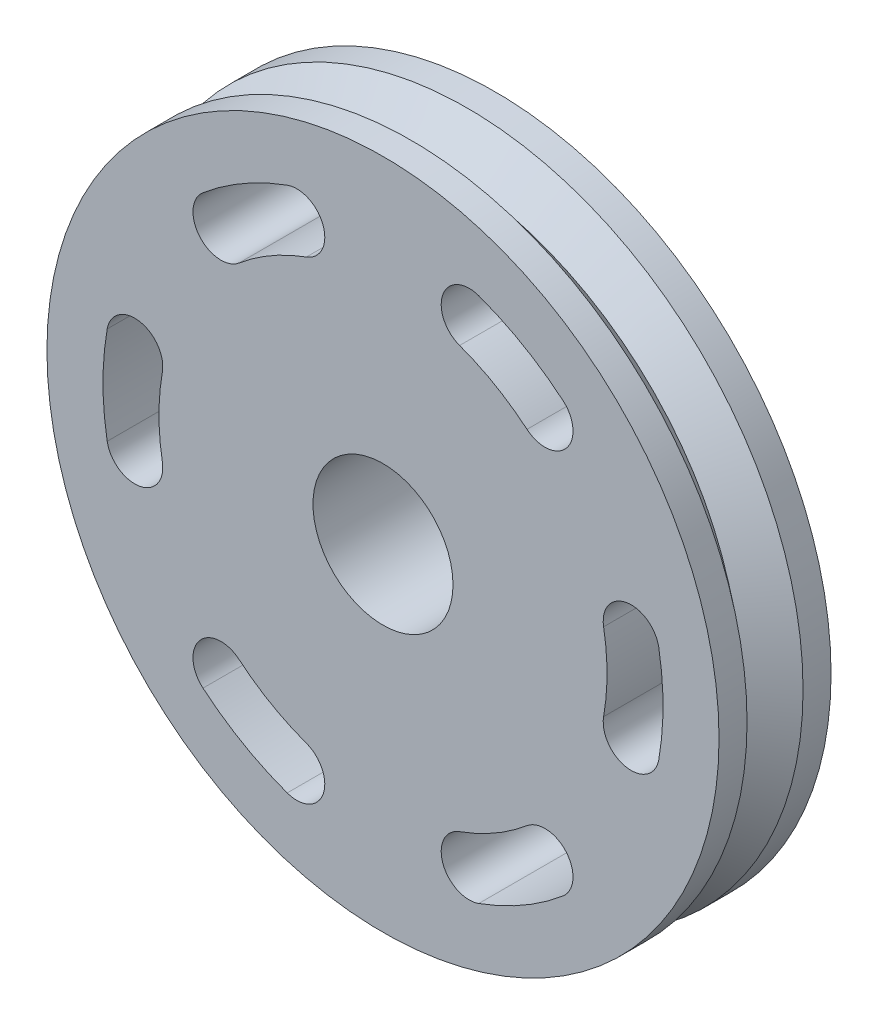
ISO-10303-21;
HEADER;
FILE_DESCRIPTION(('STEP AP214'),'2;1');
FILE_NAME('part.step','',(''),(''),'','','');
FILE_SCHEMA(('AUTOMOTIVE_DESIGN { 1 0 10303 214 1 1 1 1 }'));
ENDSEC;
DATA;
#1=APPLICATION_CONTEXT('core data for automotive mechanical design processes');
#2=APPLICATION_PROTOCOL_DEFINITION('international standard','automotive_design',2000,#1);
#3=PRODUCT_CONTEXT('',#1,'mechanical');
#4=PRODUCT('Part','Part','',(#3));
#5=PRODUCT_RELATED_PRODUCT_CATEGORY('part','',(#4));
#6=PRODUCT_DEFINITION_FORMATION('','',#4);
#7=PRODUCT_DEFINITION_CONTEXT('part definition',#1,'design');
#8=PRODUCT_DEFINITION('design','',#6,#7);
#9=PRODUCT_DEFINITION_SHAPE('','',#8);
#10=(LENGTH_UNIT() NAMED_UNIT(*) SI_UNIT(.MILLI.,.METRE.));
#11=(NAMED_UNIT(*) PLANE_ANGLE_UNIT() SI_UNIT($,.RADIAN.));
#12=(NAMED_UNIT(*) SI_UNIT($,.STERADIAN.) SOLID_ANGLE_UNIT());
#13=UNCERTAINTY_MEASURE_WITH_UNIT(LENGTH_MEASURE(1.E-05),#10,'distance_accuracy_value','');
#14=(GEOMETRIC_REPRESENTATION_CONTEXT(3) GLOBAL_UNCERTAINTY_ASSIGNED_CONTEXT((#13)) GLOBAL_UNIT_ASSIGNED_CONTEXT((#10,
#11,#12)) REPRESENTATION_CONTEXT('',''));
#15=CARTESIAN_POINT('',(0.,0.,0.));
#16=DIRECTION('',(0.,0.,1.));
#17=DIRECTION('',(1.,0.,0.));
#18=AXIS2_PLACEMENT_3D('',#15,#16,#17);
#19=CARTESIAN_POINT('',(0.,0.,-0.5));
#20=DIRECTION('',(0.,0.,-1.));
#21=DIRECTION('',(-1.,0.,0.));
#22=AXIS2_PLACEMENT_3D('',#19,#20,#21);
#23=PLANE('',#22);
#24=CARTESIAN_POINT('',(-2.21581744427747,-0.390708399750611,-0.500000000000001));
#25=DIRECTION('',(0.,0.,1.));
#26=DIRECTION('',(1.,0.,0.));
#27=AXIS2_PLACEMENT_3D('',#24,#25,#26);
#28=CIRCLE('',#27,0.25);
#29=CARTESIAN_POINT('',(-2.46201938253052,-0.434120444167345,-0.500000000000001));
#30=VERTEX_POINT('',#29);
#31=CARTESIAN_POINT('',(-1.96961550602441,-0.347296355333876,-0.500000000000001));
#32=VERTEX_POINT('',#31);
#33=EDGE_CURVE('E277',#30,#32,#28,.T.);
#34=ORIENTED_EDGE('',*,*,#33,.T.);
#35=CARTESIAN_POINT('',(0.,0.,-0.500000000000001));
#36=DIRECTION('',(0.,0.,1.));
#37=DIRECTION('',(1.,0.,0.));
#38=AXIS2_PLACEMENT_3D('',#35,#36,#37);
#39=CIRCLE('',#38,2.);
#40=CARTESIAN_POINT('',(-1.96961550602442,0.347296355333847,-0.5));
#41=VERTEX_POINT('',#40);
#42=EDGE_CURVE('E294',#41,#32,#39,.T.);
#43=ORIENTED_EDGE('',*,*,#42,.F.);
#44=CARTESIAN_POINT('',(-2.21581744427747,0.390708399750578,-0.500000000000001));
#45=DIRECTION('',(0.,0.,1.));
#46=DIRECTION('',(1.,0.,0.));
#47=AXIS2_PLACEMENT_3D('',#44,#45,#46);
#48=CIRCLE('',#47,0.250000000000001);
#49=CARTESIAN_POINT('',(-2.46201938253053,0.434120444167309,-0.500000000000001));
#50=VERTEX_POINT('',#49);
#51=EDGE_CURVE('E57',#41,#50,#48,.T.);
#52=ORIENTED_EDGE('',*,*,#51,.T.);
#53=CARTESIAN_POINT('',(0.,0.,-0.500000000000001));
#54=DIRECTION('',(0.,0.,1.));
#55=DIRECTION('',(1.,0.,0.));
#56=AXIS2_PLACEMENT_3D('',#53,#54,#55);
#57=CIRCLE('',#56,2.5);
#58=EDGE_CURVE('E261',#50,#30,#57,.T.);
#59=ORIENTED_EDGE('',*,*,#58,.T.);
#60=EDGE_LOOP('',(#34,#43,#52,#59));
#61=FACE_BOUND('',#60,.T.);
#62=CARTESIAN_POINT('',(-1.44627212179472,-1.7235999970177,-0.500000000000001));
#63=DIRECTION('',(0.,0.,1.));
#64=DIRECTION('',(1.,0.,0.));
#65=AXIS2_PLACEMENT_3D('',#62,#63,#64);
#66=CIRCLE('',#65,0.25);
#67=CARTESIAN_POINT('',(-1.28557521937309,-1.53208888623795,-0.500000000000001));
#68=VERTEX_POINT('',#67);
#69=CARTESIAN_POINT('',(-1.60696902421636,-1.91511110779744,-0.500000000000001));
#70=VERTEX_POINT('',#69);
#71=EDGE_CURVE('E320',#68,#70,#66,.T.);
#72=ORIENTED_EDGE('',*,*,#71,.T.);
#73=CARTESIAN_POINT('',(0.,0.,-0.500000000000001));
#74=DIRECTION('',(0.,0.,1.));
#75=DIRECTION('',(1.,0.,0.));
#76=AXIS2_PLACEMENT_3D('',#73,#74,#75);
#77=CIRCLE('',#76,2.5);
#78=CARTESIAN_POINT('',(-0.855050358314182,-2.34923155196477,-0.5));
#79=VERTEX_POINT('',#78);
#80=EDGE_CURVE('E334',#70,#79,#77,.T.);
#81=ORIENTED_EDGE('',*,*,#80,.T.);
#82=CARTESIAN_POINT('',(-0.769545322482764,-2.11430839676829,-0.500000000000001));
#83=DIRECTION('',(0.,0.,1.));
#84=DIRECTION('',(1.,0.,0.));
#85=AXIS2_PLACEMENT_3D('',#82,#83,#84);
#86=CIRCLE('',#85,0.25);
#87=CARTESIAN_POINT('',(-0.684040286651346,-1.87938524157182,-0.500000000000001));
#88=VERTEX_POINT('',#87);
#89=EDGE_CURVE('E65',#79,#88,#86,.T.);
#90=ORIENTED_EDGE('',*,*,#89,.T.);
#91=CARTESIAN_POINT('',(0.,0.,-0.500000000000001));
#92=DIRECTION('',(0.,0.,1.));
#93=DIRECTION('',(1.,0.,0.));
#94=AXIS2_PLACEMENT_3D('',#91,#92,#93);
#95=CIRCLE('',#94,2.);
#96=EDGE_CURVE('E304',#68,#88,#95,.T.);
#97=ORIENTED_EDGE('',*,*,#96,.F.);
#98=EDGE_LOOP('',(#72,#81,#90,#97));
#99=FACE_BOUND('',#98,.T.);
#100=CARTESIAN_POINT('',(0.769545322482751,-2.1143083967683,-0.500000000000001));
#101=DIRECTION('',(0.,0.,1.));
#102=DIRECTION('',(1.,0.,0.));
#103=AXIS2_PLACEMENT_3D('',#100,#101,#102);
#104=CIRCLE('',#103,0.250000000000001);
#105=CARTESIAN_POINT('',(0.684040286651333,-1.87938524157182,-0.500000000000001));
#106=VERTEX_POINT('',#105);
#107=CARTESIAN_POINT('',(0.855050358314166,-2.34923155196477,-0.500000000000001));
#108=VERTEX_POINT('',#107);
#109=EDGE_CURVE('E361',#106,#108,#104,.T.);
#110=ORIENTED_EDGE('',*,*,#109,.T.);
#111=CARTESIAN_POINT('',(0.,0.,-0.500000000000001));
#112=DIRECTION('',(0.,0.,1.));
#113=DIRECTION('',(1.,0.,0.));
#114=AXIS2_PLACEMENT_3D('',#111,#112,#113);
#115=CIRCLE('',#114,2.5);
#116=CARTESIAN_POINT('',(1.60696902421635,-1.91511110779745,-0.5));
#117=VERTEX_POINT('',#116);
#118=EDGE_CURVE('E377',#108,#117,#115,.T.);
#119=ORIENTED_EDGE('',*,*,#118,.T.);
#120=CARTESIAN_POINT('',(1.44627212179471,-1.7235999970177,-0.500000000000001));
#121=DIRECTION('',(0.,0.,1.));
#122=DIRECTION('',(1.,0.,0.));
#123=AXIS2_PLACEMENT_3D('',#120,#121,#122);
#124=CIRCLE('',#123,0.25);
#125=CARTESIAN_POINT('',(1.28557521937308,-1.53208888623796,-0.500000000000001));
#126=VERTEX_POINT('',#125);
#127=EDGE_CURVE('E373',#117,#126,#124,.T.);
#128=ORIENTED_EDGE('',*,*,#127,.T.);
#129=CARTESIAN_POINT('',(0.,0.,-0.500000000000001));
#130=DIRECTION('',(0.,0.,1.));
#131=DIRECTION('',(1.,0.,0.));
#132=AXIS2_PLACEMENT_3D('',#129,#130,#131);
#133=CIRCLE('',#132,2.);
#134=EDGE_CURVE('E345',#106,#126,#133,.T.);
#135=ORIENTED_EDGE('',*,*,#134,.F.);
#136=EDGE_LOOP('',(#110,#119,#128,#135));
#137=FACE_BOUND('',#136,.T.);
#138=CARTESIAN_POINT('',(2.21581744427747,-0.390708399750593,-0.500000000000001));
#139=DIRECTION('',(0.,0.,1.));
#140=DIRECTION('',(1.,0.,0.));
#141=AXIS2_PLACEMENT_3D('',#138,#139,#140);
#142=CIRCLE('',#141,0.250000000000001);
#143=CARTESIAN_POINT('',(1.96961550602442,-0.347296355333861,-0.500000000000001));
#144=VERTEX_POINT('',#143);
#145=CARTESIAN_POINT('',(2.46201938253052,-0.434120444167326,-0.500000000000001));
#146=VERTEX_POINT('',#145);
#147=EDGE_CURVE('E403',#144,#146,#142,.T.);
#148=ORIENTED_EDGE('',*,*,#147,.T.);
#149=CARTESIAN_POINT('',(0.,0.,-0.500000000000001));
#150=DIRECTION('',(0.,0.,1.));
#151=DIRECTION('',(1.,0.,0.));
#152=AXIS2_PLACEMENT_3D('',#149,#150,#151);
#153=CIRCLE('',#152,2.5);
#154=CARTESIAN_POINT('',(2.46201938253052,0.434120444167328,-0.5));
#155=VERTEX_POINT('',#154);
#156=EDGE_CURVE('E419',#146,#155,#153,.T.);
#157=ORIENTED_EDGE('',*,*,#156,.T.);
#158=CARTESIAN_POINT('',(2.21581744427747,0.390708399750595,-0.500000000000001));
#159=DIRECTION('',(0.,0.,1.));
#160=DIRECTION('',(1.,0.,0.));
#161=AXIS2_PLACEMENT_3D('',#158,#159,#160);
#162=CIRCLE('',#161,0.25);
#163=CARTESIAN_POINT('',(1.96961550602442,0.347296355333862,-0.500000000000001));
#164=VERTEX_POINT('',#163);
#165=EDGE_CURVE('E415',#155,#164,#162,.T.);
#166=ORIENTED_EDGE('',*,*,#165,.T.);
#167=CARTESIAN_POINT('',(0.,0.,-0.500000000000001));
#168=DIRECTION('',(0.,0.,1.));
#169=DIRECTION('',(1.,0.,0.));
#170=AXIS2_PLACEMENT_3D('',#167,#168,#169);
#171=CIRCLE('',#170,2.);
#172=EDGE_CURVE('E388',#144,#164,#171,.T.);
#173=ORIENTED_EDGE('',*,*,#172,.F.);
#174=EDGE_LOOP('',(#148,#157,#166,#173));
#175=FACE_BOUND('',#174,.T.);
#176=CARTESIAN_POINT('',(0.,0.,-0.500000000000001));
#177=DIRECTION('',(0.,0.,1.));
#178=DIRECTION('',(1.,0.,0.));
#179=AXIS2_PLACEMENT_3D('',#176,#177,#178);
#180=CIRCLE('',#179,0.625);
#181=CARTESIAN_POINT('',(0.625,0.,-0.500000000000001));
#182=VERTEX_POINT('',#181);
#183=EDGE_CURVE('E232',#182,#182,#180,.T.);
#184=ORIENTED_EDGE('',*,*,#183,.T.);
#185=EDGE_LOOP('',(#184));
#186=FACE_BOUND('',#185,.T.);
#187=CARTESIAN_POINT('',(1.44627212179471,1.72359999701771,-0.500000000000001));
#188=DIRECTION('',(0.,0.,1.));
#189=DIRECTION('',(1.,0.,0.));
#190=AXIS2_PLACEMENT_3D('',#187,#188,#189);
#191=CIRCLE('',#190,0.250000000000001);
#192=CARTESIAN_POINT('',(1.28557521937307,1.53208888623796,-0.500000000000001));
#193=VERTEX_POINT('',#192);
#194=CARTESIAN_POINT('',(1.60696902421634,1.91511110779745,-0.500000000000001));
#195=VERTEX_POINT('',#194);
#196=EDGE_CURVE('E210',#193,#195,#191,.T.);
#197=ORIENTED_EDGE('',*,*,#196,.T.);
#198=CARTESIAN_POINT('',(0.,0.,-0.500000000000001));
#199=DIRECTION('',(0.,0.,1.));
#200=DIRECTION('',(1.,0.,0.));
#201=AXIS2_PLACEMENT_3D('',#198,#199,#200);
#202=CIRCLE('',#201,2.5);
#203=CARTESIAN_POINT('',(0.855050358314165,2.34923155196477,-0.5));
#204=VERTEX_POINT('',#203);
#205=EDGE_CURVE('E251',#195,#204,#202,.T.);
#206=ORIENTED_EDGE('',*,*,#205,.T.);
#207=CARTESIAN_POINT('',(0.769545322482749,2.1143083967683,-0.500000000000001));
#208=DIRECTION('',(0.,0.,1.));
#209=DIRECTION('',(1.,0.,0.));
#210=AXIS2_PLACEMENT_3D('',#207,#208,#209);
#211=CIRCLE('',#210,0.25);
#212=CARTESIAN_POINT('',(0.684040286651332,1.87938524157182,-0.500000000000001));
#213=VERTEX_POINT('',#212);
#214=EDGE_CURVE('E246',#204,#213,#211,.T.);
#215=ORIENTED_EDGE('',*,*,#214,.T.);
#216=CARTESIAN_POINT('',(0.,0.,-0.500000000000001));
#217=DIRECTION('',(0.,0.,1.));
#218=DIRECTION('',(1.,0.,0.));
#219=AXIS2_PLACEMENT_3D('',#216,#217,#218);
#220=CIRCLE('',#219,2.);
#221=EDGE_CURVE('E243',#193,#213,#220,.T.);
#222=ORIENTED_EDGE('',*,*,#221,.F.);
#223=EDGE_LOOP('',(#197,#206,#215,#222));
#224=FACE_BOUND('',#223,.T.);
#225=CARTESIAN_POINT('',(-0.769545322482766,2.11430839676829,-0.500000000000001));
#226=DIRECTION('',(0.,0.,1.));
#227=DIRECTION('',(1.,0.,0.));
#228=AXIS2_PLACEMENT_3D('',#225,#226,#227);
#229=CIRCLE('',#228,0.25);
#230=CARTESIAN_POINT('',(-0.684040286651346,1.87938524157181,-0.500000000000001));
#231=VERTEX_POINT('',#230);
#232=CARTESIAN_POINT('',(-0.855050358314183,2.34923155196477,-0.500000000000001));
#233=VERTEX_POINT('',#232);
#234=EDGE_CURVE('E426',#231,#233,#229,.T.);
#235=ORIENTED_EDGE('',*,*,#234,.T.);
#236=CARTESIAN_POINT('',(0.,0.,-0.500000000000001));
#237=DIRECTION('',(0.,0.,1.));
#238=DIRECTION('',(1.,0.,0.));
#239=AXIS2_PLACEMENT_3D('',#236,#237,#238);
#240=CIRCLE('',#239,2.5);
#241=CARTESIAN_POINT('',(-1.60696902421636,1.91511110779744,-0.5));
#242=VERTEX_POINT('',#241);
#243=EDGE_CURVE('E430',#233,#242,#240,.T.);
#244=ORIENTED_EDGE('',*,*,#243,.T.);
#245=CARTESIAN_POINT('',(-1.44627212179472,1.72359999701769,-0.500000000000001));
#246=DIRECTION('',(0.,0.,1.));
#247=DIRECTION('',(1.,0.,0.));
#248=AXIS2_PLACEMENT_3D('',#245,#246,#247);
#249=CIRCLE('',#248,0.25);
#250=CARTESIAN_POINT('',(-1.28557521937309,1.53208888623795,-0.500000000000001));
#251=VERTEX_POINT('',#250);
#252=EDGE_CURVE('E435',#242,#251,#249,.T.);
#253=ORIENTED_EDGE('',*,*,#252,.T.);
#254=CARTESIAN_POINT('',(0.,0.,-0.500000000000001));
#255=DIRECTION('',(0.,0.,1.));
#256=DIRECTION('',(1.,0.,0.));
#257=AXIS2_PLACEMENT_3D('',#254,#255,#256);
#258=CIRCLE('',#257,2.);
#259=EDGE_CURVE('E439',#231,#251,#258,.T.);
#260=ORIENTED_EDGE('',*,*,#259,.F.);
#261=EDGE_LOOP('',(#235,#244,#253,#260));
#262=FACE_BOUND('',#261,.T.);
#263=CARTESIAN_POINT('',(0.,0.,-0.500000000000001));
#264=DIRECTION('',(0.,0.,1.));
#265=DIRECTION('',(1.,0.,0.));
#266=AXIS2_PLACEMENT_3D('',#263,#264,#265);
#267=CIRCLE('',#266,3.);
#268=CARTESIAN_POINT('',(3.,0.,-0.500000000000001));
#269=VERTEX_POINT('',#268);
#270=EDGE_CURVE('E11',#269,#269,#267,.T.);
#271=ORIENTED_EDGE('',*,*,#270,.F.);
#272=EDGE_LOOP('',(#271));
#273=FACE_BOUND('',#272,.T.);
#274=ADVANCED_FACE('F42',(#61,#99,#137,#175,#186,#224,#262,#273),#23,.T.);
#275=CARTESIAN_POINT('',(0.,0.,1.40451509183664));
#276=DIRECTION('',(0.,0.,1.));
#277=DIRECTION('',(1.,0.,0.));
#278=AXIS2_PLACEMENT_3D('',#275,#276,#277);
#279=CYLINDRICAL_SURFACE('',#278,3.);
#280=ORIENTED_EDGE('',*,*,#270,.T.);
#281=EDGE_LOOP('',(#280));
#282=FACE_BOUND('',#281,.T.);
#283=CARTESIAN_POINT('',(0.,0.,-0.250000000000001));
#284=DIRECTION('',(0.,0.,1.));
#285=DIRECTION('',(1.,0.,0.));
#286=AXIS2_PLACEMENT_3D('',#283,#284,#285);
#287=CIRCLE('',#286,3.);
#288=CARTESIAN_POINT('',(3.,0.,-0.250000000000001));
#289=VERTEX_POINT('',#288);
#290=EDGE_CURVE('E50',#289,#289,#287,.T.);
#291=ORIENTED_EDGE('',*,*,#290,.F.);
#292=EDGE_LOOP('',(#291));
#293=FACE_BOUND('',#292,.T.);
#294=ADVANCED_FACE('F487',(#282,#293),#279,.T.);
#295=CARTESIAN_POINT('',(0.,0.,0.));
#296=DIRECTION('',(0.,0.,-1.));
#297=DIRECTION('',(-1.,0.,0.));
#298=AXIS2_PLACEMENT_3D('',#295,#296,#297);
#299=CONICAL_SURFACE('',#298,2.69,0.892133836046583);
#300=ORIENTED_EDGE('',*,*,#290,.T.);
#301=EDGE_LOOP('',(#300));
#302=FACE_BOUND('',#301,.T.);
#303=CARTESIAN_POINT('',(0.,0.,0.));
#304=DIRECTION('',(0.,0.,1.));
#305=DIRECTION('',(1.,0.,0.));
#306=AXIS2_PLACEMENT_3D('',#303,#304,#305);
#307=CIRCLE('',#306,2.69);
#308=CARTESIAN_POINT('',(2.69,0.,0.));
#309=VERTEX_POINT('',#308);
#310=EDGE_CURVE('E476',#309,#309,#307,.T.);
#311=ORIENTED_EDGE('',*,*,#310,.F.);
#312=EDGE_LOOP('',(#311));
#313=FACE_BOUND('',#312,.T.);
#314=ADVANCED_FACE('F484',(#302,#313),#299,.T.);
#315=CARTESIAN_POINT('',(0.,0.,0.));
#316=DIRECTION('',(0.,0.,1.));
#317=DIRECTION('',(1.,0.,0.));
#318=AXIS2_PLACEMENT_3D('',#315,#316,#317);
#319=CONICAL_SURFACE('',#318,2.69,0.892133836046582);
#320=CARTESIAN_POINT('',(0.,0.,0.250000000000001));
#321=DIRECTION('',(0.,0.,1.));
#322=DIRECTION('',(1.,0.,0.));
#323=AXIS2_PLACEMENT_3D('',#320,#321,#322);
#324=CIRCLE('',#323,3.);
#325=CARTESIAN_POINT('',(3.,0.,0.250000000000001));
#326=VERTEX_POINT('',#325);
#327=EDGE_CURVE('E472',#326,#326,#324,.T.);
#328=ORIENTED_EDGE('',*,*,#327,.F.);
#329=EDGE_LOOP('',(#328));
#330=FACE_BOUND('',#329,.T.);
#331=ORIENTED_EDGE('',*,*,#310,.T.);
#332=EDGE_LOOP('',(#331));
#333=FACE_BOUND('',#332,.T.);
#334=ADVANCED_FACE('F494',(#330,#333),#319,.T.);
#335=CARTESIAN_POINT('',(0.,0.,1.40451509183664));
#336=DIRECTION('',(0.,0.,1.));
#337=DIRECTION('',(1.,0.,0.));
#338=AXIS2_PLACEMENT_3D('',#335,#336,#337);
#339=CYLINDRICAL_SURFACE('',#338,3.);
#340=CARTESIAN_POINT('',(0.,0.,0.500000000000001));
#341=DIRECTION('',(0.,0.,1.));
#342=DIRECTION('',(1.,0.,0.));
#343=AXIS2_PLACEMENT_3D('',#340,#341,#342);
#344=CIRCLE('',#343,3.);
#345=CARTESIAN_POINT('',(3.,0.,0.500000000000001));
#346=VERTEX_POINT('',#345);
#347=EDGE_CURVE('E459',#346,#346,#344,.T.);
#348=ORIENTED_EDGE('',*,*,#347,.F.);
#349=EDGE_LOOP('',(#348));
#350=FACE_BOUND('',#349,.T.);
#351=ORIENTED_EDGE('',*,*,#327,.T.);
#352=EDGE_LOOP('',(#351));
#353=FACE_BOUND('',#352,.T.);
#354=ADVANCED_FACE('F500',(#350,#353),#339,.T.);
#355=CARTESIAN_POINT('',(0.,0.,0.5));
#356=DIRECTION('',(0.,0.,-1.));
#357=DIRECTION('',(-1.,0.,0.));
#358=AXIS2_PLACEMENT_3D('',#355,#356,#357);
#359=PLANE('',#358);
#360=CARTESIAN_POINT('',(0.,0.,0.5));
#361=DIRECTION('',(0.,0.,1.));
#362=DIRECTION('',(1.,0.,0.));
#363=AXIS2_PLACEMENT_3D('',#360,#361,#362);
#364=CIRCLE('',#363,2.);
#365=CARTESIAN_POINT('',(-1.96961550602442,0.347296355333847,0.5));
#366=VERTEX_POINT('',#365);
#367=CARTESIAN_POINT('',(-1.96961550602441,-0.347296355333876,0.5));
#368=VERTEX_POINT('',#367);
#369=EDGE_CURVE('E281',#366,#368,#364,.T.);
#370=ORIENTED_EDGE('',*,*,#369,.T.);
#371=CARTESIAN_POINT('',(-2.21581744427747,-0.390708399750611,0.5));
#372=DIRECTION('',(0.,0.,1.));
#373=DIRECTION('',(1.,0.,0.));
#374=AXIS2_PLACEMENT_3D('',#371,#372,#373);
#375=CIRCLE('',#374,0.25);
#376=CARTESIAN_POINT('',(-2.46201938253052,-0.434120444167345,0.5));
#377=VERTEX_POINT('',#376);
#378=EDGE_CURVE('E285',#377,#368,#375,.T.);
#379=ORIENTED_EDGE('',*,*,#378,.F.);
#380=CARTESIAN_POINT('',(0.,0.,0.5));
#381=DIRECTION('',(0.,0.,1.));
#382=DIRECTION('',(1.,0.,0.));
#383=AXIS2_PLACEMENT_3D('',#380,#381,#382);
#384=CIRCLE('',#383,2.5);
#385=CARTESIAN_POINT('',(-2.46201938253053,0.434120444167309,0.5));
#386=VERTEX_POINT('',#385);
#387=EDGE_CURVE('E272',#386,#377,#384,.T.);
#388=ORIENTED_EDGE('',*,*,#387,.F.);
#389=CARTESIAN_POINT('',(-2.21581744427747,0.390708399750578,0.5));
#390=DIRECTION('',(0.,0.,1.));
#391=DIRECTION('',(1.,0.,0.));
#392=AXIS2_PLACEMENT_3D('',#389,#390,#391);
#393=CIRCLE('',#392,0.250000000000001);
#394=EDGE_CURVE('E276',#366,#386,#393,.T.);
#395=ORIENTED_EDGE('',*,*,#394,.F.);
#396=EDGE_LOOP('',(#370,#379,#388,#395));
#397=FACE_BOUND('',#396,.T.);
#398=CARTESIAN_POINT('',(0.,0.,0.5));
#399=DIRECTION('',(0.,0.,1.));
#400=DIRECTION('',(1.,0.,0.));
#401=AXIS2_PLACEMENT_3D('',#398,#399,#400);
#402=CIRCLE('',#401,2.5);
#403=CARTESIAN_POINT('',(-1.60696902421636,-1.91511110779744,0.5));
#404=VERTEX_POINT('',#403);
#405=CARTESIAN_POINT('',(-0.855050358314182,-2.34923155196477,0.5));
#406=VERTEX_POINT('',#405);
#407=EDGE_CURVE('E324',#404,#406,#402,.T.);
#408=ORIENTED_EDGE('',*,*,#407,.F.);
#409=CARTESIAN_POINT('',(-1.44627212179472,-1.7235999970177,0.5));
#410=DIRECTION('',(0.,0.,1.));
#411=DIRECTION('',(1.,0.,0.));
#412=AXIS2_PLACEMENT_3D('',#409,#410,#411);
#413=CIRCLE('',#412,0.25);
#414=CARTESIAN_POINT('',(-1.28557521937309,-1.53208888623795,0.5));
#415=VERTEX_POINT('',#414);
#416=EDGE_CURVE('E271',#415,#404,#413,.T.);
#417=ORIENTED_EDGE('',*,*,#416,.F.);
#418=CARTESIAN_POINT('',(0.,0.,0.5));
#419=DIRECTION('',(0.,0.,1.));
#420=DIRECTION('',(1.,0.,0.));
#421=AXIS2_PLACEMENT_3D('',#418,#419,#420);
#422=CIRCLE('',#421,2.);
#423=CARTESIAN_POINT('',(-0.684040286651346,-1.87938524157182,0.5));
#424=VERTEX_POINT('',#423);
#425=EDGE_CURVE('E315',#415,#424,#422,.T.);
#426=ORIENTED_EDGE('',*,*,#425,.T.);
#427=CARTESIAN_POINT('',(-0.769545322482764,-2.11430839676829,0.5));
#428=DIRECTION('',(0.,0.,1.));
#429=DIRECTION('',(1.,0.,0.));
#430=AXIS2_PLACEMENT_3D('',#427,#428,#429);
#431=CIRCLE('',#430,0.25);
#432=EDGE_CURVE('E319',#406,#424,#431,.T.);
#433=ORIENTED_EDGE('',*,*,#432,.F.);
#434=EDGE_LOOP('',(#408,#417,#426,#433));
#435=FACE_BOUND('',#434,.T.);
#436=CARTESIAN_POINT('',(0.,0.,0.5));
#437=DIRECTION('',(0.,0.,1.));
#438=DIRECTION('',(1.,0.,0.));
#439=AXIS2_PLACEMENT_3D('',#436,#437,#438);
#440=CIRCLE('',#439,2.5);
#441=CARTESIAN_POINT('',(0.855050358314166,-2.34923155196477,0.5));
#442=VERTEX_POINT('',#441);
#443=CARTESIAN_POINT('',(1.60696902421635,-1.91511110779745,0.5));
#444=VERTEX_POINT('',#443);
#445=EDGE_CURVE('E365',#442,#444,#440,.T.);
#446=ORIENTED_EDGE('',*,*,#445,.F.);
#447=CARTESIAN_POINT('',(0.769545322482751,-2.1143083967683,0.5));
#448=DIRECTION('',(0.,0.,1.));
#449=DIRECTION('',(1.,0.,0.));
#450=AXIS2_PLACEMENT_3D('',#447,#448,#449);
#451=CIRCLE('',#450,0.250000000000001);
#452=CARTESIAN_POINT('',(0.684040286651333,-1.87938524157182,0.5));
#453=VERTEX_POINT('',#452);
#454=EDGE_CURVE('E314',#453,#442,#451,.T.);
#455=ORIENTED_EDGE('',*,*,#454,.F.);
#456=CARTESIAN_POINT('',(0.,0.,0.5));
#457=DIRECTION('',(0.,0.,1.));
#458=DIRECTION('',(1.,0.,0.));
#459=AXIS2_PLACEMENT_3D('',#456,#457,#458);
#460=CIRCLE('',#459,2.);
#461=CARTESIAN_POINT('',(1.28557521937308,-1.53208888623796,0.5));
#462=VERTEX_POINT('',#461);
#463=EDGE_CURVE('E356',#453,#462,#460,.T.);
#464=ORIENTED_EDGE('',*,*,#463,.T.);
#465=CARTESIAN_POINT('',(1.44627212179471,-1.7235999970177,0.5));
#466=DIRECTION('',(0.,0.,1.));
#467=DIRECTION('',(1.,0.,0.));
#468=AXIS2_PLACEMENT_3D('',#465,#466,#467);
#469=CIRCLE('',#468,0.25);
#470=EDGE_CURVE('E360',#444,#462,#469,.T.);
#471=ORIENTED_EDGE('',*,*,#470,.F.);
#472=EDGE_LOOP('',(#446,#455,#464,#471));
#473=FACE_BOUND('',#472,.T.);
#474=CARTESIAN_POINT('',(0.,0.,0.5));
#475=DIRECTION('',(0.,0.,1.));
#476=DIRECTION('',(1.,0.,0.));
#477=AXIS2_PLACEMENT_3D('',#474,#475,#476);
#478=CIRCLE('',#477,2.5);
#479=CARTESIAN_POINT('',(2.46201938253052,-0.434120444167326,0.5));
#480=VERTEX_POINT('',#479);
#481=CARTESIAN_POINT('',(2.46201938253052,0.434120444167328,0.5));
#482=VERTEX_POINT('',#481);
#483=EDGE_CURVE('E407',#480,#482,#478,.T.);
#484=ORIENTED_EDGE('',*,*,#483,.F.);
#485=CARTESIAN_POINT('',(2.21581744427747,-0.390708399750593,0.5));
#486=DIRECTION('',(0.,0.,1.));
#487=DIRECTION('',(1.,0.,0.));
#488=AXIS2_PLACEMENT_3D('',#485,#486,#487);
#489=CIRCLE('',#488,0.250000000000001);
#490=CARTESIAN_POINT('',(1.96961550602442,-0.347296355333861,0.5));
#491=VERTEX_POINT('',#490);
#492=EDGE_CURVE('E355',#491,#480,#489,.T.);
#493=ORIENTED_EDGE('',*,*,#492,.F.);
#494=CARTESIAN_POINT('',(0.,0.,0.5));
#495=DIRECTION('',(0.,0.,1.));
#496=DIRECTION('',(1.,0.,0.));
#497=AXIS2_PLACEMENT_3D('',#494,#495,#496);
#498=CIRCLE('',#497,2.);
#499=CARTESIAN_POINT('',(1.96961550602442,0.347296355333862,0.5));
#500=VERTEX_POINT('',#499);
#501=EDGE_CURVE('E398',#491,#500,#498,.T.);
#502=ORIENTED_EDGE('',*,*,#501,.T.);
#503=CARTESIAN_POINT('',(2.21581744427747,0.390708399750595,0.5));
#504=DIRECTION('',(0.,0.,1.));
#505=DIRECTION('',(1.,0.,0.));
#506=AXIS2_PLACEMENT_3D('',#503,#504,#505);
#507=CIRCLE('',#506,0.25);
#508=EDGE_CURVE('E402',#482,#500,#507,.T.);
#509=ORIENTED_EDGE('',*,*,#508,.F.);
#510=EDGE_LOOP('',(#484,#493,#502,#509));
#511=FACE_BOUND('',#510,.T.);
#512=CARTESIAN_POINT('',(0.,0.,0.5));
#513=DIRECTION('',(0.,0.,1.));
#514=DIRECTION('',(1.,0.,0.));
#515=AXIS2_PLACEMENT_3D('',#512,#513,#514);
#516=CIRCLE('',#515,0.625);
#517=CARTESIAN_POINT('',(0.625,0.,0.5));
#518=VERTEX_POINT('',#517);
#519=EDGE_CURVE('E238',#518,#518,#516,.T.);
#520=ORIENTED_EDGE('',*,*,#519,.F.);
#521=EDGE_LOOP('',(#520));
#522=FACE_BOUND('',#521,.T.);
#523=CARTESIAN_POINT('',(0.,0.,0.5));
#524=DIRECTION('',(0.,0.,1.));
#525=DIRECTION('',(1.,0.,0.));
#526=AXIS2_PLACEMENT_3D('',#523,#524,#525);
#527=CIRCLE('',#526,2.5);
#528=CARTESIAN_POINT('',(1.60696902421634,1.91511110779745,0.5));
#529=VERTEX_POINT('',#528);
#530=CARTESIAN_POINT('',(0.855050358314165,2.34923155196477,0.5));
#531=VERTEX_POINT('',#530);
#532=EDGE_CURVE('E230',#529,#531,#527,.T.);
#533=ORIENTED_EDGE('',*,*,#532,.F.);
#534=CARTESIAN_POINT('',(1.44627212179471,1.72359999701771,0.5));
#535=DIRECTION('',(0.,0.,1.));
#536=DIRECTION('',(1.,0.,0.));
#537=AXIS2_PLACEMENT_3D('',#534,#535,#536);
#538=CIRCLE('',#537,0.250000000000001);
#539=CARTESIAN_POINT('',(1.28557521937307,1.53208888623796,0.5));
#540=VERTEX_POINT('',#539);
#541=EDGE_CURVE('E207',#540,#529,#538,.T.);
#542=ORIENTED_EDGE('',*,*,#541,.F.);
#543=CARTESIAN_POINT('',(0.,0.,0.5));
#544=DIRECTION('',(0.,0.,1.));
#545=DIRECTION('',(1.,0.,0.));
#546=AXIS2_PLACEMENT_3D('',#543,#544,#545);
#547=CIRCLE('',#546,2.);
#548=CARTESIAN_POINT('',(0.684040286651332,1.87938524157182,0.5));
#549=VERTEX_POINT('',#548);
#550=EDGE_CURVE('E217',#540,#549,#547,.T.);
#551=ORIENTED_EDGE('',*,*,#550,.T.);
#552=CARTESIAN_POINT('',(0.769545322482749,2.1143083967683,0.5));
#553=DIRECTION('',(0.,0.,1.));
#554=DIRECTION('',(1.,0.,0.));
#555=AXIS2_PLACEMENT_3D('',#552,#553,#554);
#556=CIRCLE('',#555,0.25);
#557=EDGE_CURVE('E224',#531,#549,#556,.T.);
#558=ORIENTED_EDGE('',*,*,#557,.F.);
#559=EDGE_LOOP('',(#533,#542,#551,#558));
#560=FACE_BOUND('',#559,.T.);
#561=CARTESIAN_POINT('',(0.,0.,0.5));
#562=DIRECTION('',(0.,0.,1.));
#563=DIRECTION('',(1.,0.,0.));
#564=AXIS2_PLACEMENT_3D('',#561,#562,#563);
#565=CIRCLE('',#564,2.5);
#566=CARTESIAN_POINT('',(-0.855050358314183,2.34923155196477,0.5));
#567=VERTEX_POINT('',#566);
#568=CARTESIAN_POINT('',(-1.60696902421636,1.91511110779744,0.5));
#569=VERTEX_POINT('',#568);
#570=EDGE_CURVE('E445',#567,#569,#565,.T.);
#571=ORIENTED_EDGE('',*,*,#570,.F.);
#572=CARTESIAN_POINT('',(-0.769545322482766,2.11430839676829,0.5));
#573=DIRECTION('',(0.,0.,1.));
#574=DIRECTION('',(1.,0.,0.));
#575=AXIS2_PLACEMENT_3D('',#572,#573,#574);
#576=CIRCLE('',#575,0.25);
#577=CARTESIAN_POINT('',(-0.684040286651346,1.87938524157181,0.5));
#578=VERTEX_POINT('',#577);
#579=EDGE_CURVE('E288',#578,#567,#576,.T.);
#580=ORIENTED_EDGE('',*,*,#579,.F.);
#581=CARTESIAN_POINT('',(0.,0.,0.5));
#582=DIRECTION('',(0.,0.,1.));
#583=DIRECTION('',(1.,0.,0.));
#584=AXIS2_PLACEMENT_3D('',#581,#582,#583);
#585=CIRCLE('',#584,2.);
#586=CARTESIAN_POINT('',(-1.28557521937309,1.53208888623795,0.5));
#587=VERTEX_POINT('',#586);
#588=EDGE_CURVE('E431',#578,#587,#585,.T.);
#589=ORIENTED_EDGE('',*,*,#588,.T.);
#590=CARTESIAN_POINT('',(-1.44627212179472,1.72359999701769,0.5));
#591=DIRECTION('',(0.,0.,1.));
#592=DIRECTION('',(1.,0.,0.));
#593=AXIS2_PLACEMENT_3D('',#590,#591,#592);
#594=CIRCLE('',#593,0.25);
#595=EDGE_CURVE('E449',#569,#587,#594,.T.);
#596=ORIENTED_EDGE('',*,*,#595,.F.);
#597=EDGE_LOOP('',(#571,#580,#589,#596));
#598=FACE_BOUND('',#597,.T.);
#599=ORIENTED_EDGE('',*,*,#347,.T.);
#600=EDGE_LOOP('',(#599));
#601=FACE_BOUND('',#600,.T.);
#602=ADVANCED_FACE('F227',(#397,#435,#473,#511,#522,#560,#598,#601),#359,.F.);
#603=CARTESIAN_POINT('',(-0.769545322482766,2.11430839676829,-0.500000000000001));
#604=DIRECTION('',(0.,0.,1.));
#605=DIRECTION('',(1.,0.,0.));
#606=AXIS2_PLACEMENT_3D('',#603,#604,#605);
#607=CYLINDRICAL_SURFACE('',#606,0.25);
#608=ORIENTED_EDGE('',*,*,#579,.T.);
#609=DIRECTION('',(0.,0.,1.));
#610=VECTOR('',#609,1.);
#611=CARTESIAN_POINT('',(-0.855050358314183,2.34923155196477,-0.500000000000001));
#612=LINE('',#611,#610);
#613=EDGE_CURVE('E442',#233,#567,#612,.T.);
#614=ORIENTED_EDGE('',*,*,#613,.F.);
#615=ORIENTED_EDGE('',*,*,#234,.F.);
#616=DIRECTION('',(0.,0.,1.));
#617=VECTOR('',#616,1.);
#618=CARTESIAN_POINT('',(-0.684040286651346,1.87938524157181,-0.500000000000001));
#619=LINE('',#618,#617);
#620=EDGE_CURVE('E456',#231,#578,#619,.T.);
#621=ORIENTED_EDGE('',*,*,#620,.T.);
#622=EDGE_LOOP('',(#608,#614,#615,#621));
#623=FACE_BOUND('',#622,.T.);
#624=ADVANCED_FACE('F507',(#623),#607,.F.);
#625=CARTESIAN_POINT('',(0.,0.,-0.500000000000001));
#626=DIRECTION('',(0.,0.,1.));
#627=DIRECTION('',(1.,0.,0.));
#628=AXIS2_PLACEMENT_3D('',#625,#626,#627);
#629=CYLINDRICAL_SURFACE('',#628,2.);
#630=ORIENTED_EDGE('',*,*,#588,.F.);
#631=ORIENTED_EDGE('',*,*,#620,.F.);
#632=ORIENTED_EDGE('',*,*,#259,.T.);
#633=DIRECTION('',(0.,0.,1.));
#634=VECTOR('',#633,1.);
#635=CARTESIAN_POINT('',(-1.28557521937309,1.53208888623795,-0.500000000000001));
#636=LINE('',#635,#634);
#637=EDGE_CURVE('E460',#251,#587,#636,.T.);
#638=ORIENTED_EDGE('',*,*,#637,.T.);
#639=EDGE_LOOP('',(#630,#631,#632,#638));
#640=FACE_BOUND('',#639,.T.);
#641=ADVANCED_FACE('F511',(#640),#629,.T.);
#642=CARTESIAN_POINT('',(-1.44627212179472,1.72359999701769,-0.500000000000001));
#643=DIRECTION('',(0.,0.,1.));
#644=DIRECTION('',(1.,0.,0.));
#645=AXIS2_PLACEMENT_3D('',#642,#643,#644);
#646=CYLINDRICAL_SURFACE('',#645,0.25);
#647=ORIENTED_EDGE('',*,*,#595,.T.);
#648=ORIENTED_EDGE('',*,*,#637,.F.);
#649=ORIENTED_EDGE('',*,*,#252,.F.);
#650=DIRECTION('',(0.,0.,1.));
#651=VECTOR('',#650,1.);
#652=CARTESIAN_POINT('',(-1.60696902421636,1.91511110779744,-0.500000000000001));
#653=LINE('',#652,#651);
#654=EDGE_CURVE('E463',#242,#569,#653,.T.);
#655=ORIENTED_EDGE('',*,*,#654,.T.);
#656=EDGE_LOOP('',(#647,#648,#649,#655));
#657=FACE_BOUND('',#656,.T.);
#658=ADVANCED_FACE('F516',(#657),#646,.F.);
#659=CARTESIAN_POINT('',(0.,0.,-0.500000000000001));
#660=DIRECTION('',(0.,0.,1.));
#661=DIRECTION('',(1.,0.,0.));
#662=AXIS2_PLACEMENT_3D('',#659,#660,#661);
#663=CYLINDRICAL_SURFACE('',#662,2.5);
#664=ORIENTED_EDGE('',*,*,#570,.T.);
#665=ORIENTED_EDGE('',*,*,#654,.F.);
#666=ORIENTED_EDGE('',*,*,#243,.F.);
#667=ORIENTED_EDGE('',*,*,#613,.T.);
#668=EDGE_LOOP('',(#664,#665,#666,#667));
#669=FACE_BOUND('',#668,.T.);
#670=ADVANCED_FACE('F513',(#669),#663,.F.);
#671=CARTESIAN_POINT('',(1.44627212179471,1.72359999701771,-0.500000000000001));
#672=DIRECTION('',(0.,0.,1.));
#673=DIRECTION('',(1.,0.,0.));
#674=AXIS2_PLACEMENT_3D('',#671,#672,#673);
#675=CYLINDRICAL_SURFACE('',#674,0.250000000000001);
#676=ORIENTED_EDGE('',*,*,#541,.T.);
#677=DIRECTION('',(0.,0.,1.));
#678=VECTOR('',#677,1.);
#679=CARTESIAN_POINT('',(1.60696902421634,1.91511110779745,-0.500000000000001));
#680=LINE('',#679,#678);
#681=EDGE_CURVE('E247',#195,#529,#680,.T.);
#682=ORIENTED_EDGE('',*,*,#681,.F.);
#683=ORIENTED_EDGE('',*,*,#196,.F.);
#684=DIRECTION('',(0.,0.,1.));
#685=VECTOR('',#684,1.);
#686=CARTESIAN_POINT('',(1.28557521937307,1.53208888623796,-0.500000000000001));
#687=LINE('',#686,#685);
#688=EDGE_CURVE('E203',#193,#540,#687,.T.);
#689=ORIENTED_EDGE('',*,*,#688,.T.);
#690=EDGE_LOOP('',(#676,#682,#683,#689));
#691=FACE_BOUND('',#690,.T.);
#692=ADVANCED_FACE('F205',(#691),#675,.F.);
#693=CARTESIAN_POINT('',(0.,0.,-0.500000000000001));
#694=DIRECTION('',(0.,0.,1.));
#695=DIRECTION('',(1.,0.,0.));
#696=AXIS2_PLACEMENT_3D('',#693,#694,#695);
#697=CYLINDRICAL_SURFACE('',#696,2.);
#698=ORIENTED_EDGE('',*,*,#550,.F.);
#699=ORIENTED_EDGE('',*,*,#688,.F.);
#700=ORIENTED_EDGE('',*,*,#221,.T.);
#701=DIRECTION('',(0.,0.,1.));
#702=VECTOR('',#701,1.);
#703=CARTESIAN_POINT('',(0.684040286651332,1.87938524157182,-0.500000000000001));
#704=LINE('',#703,#702);
#705=EDGE_CURVE('E214',#213,#549,#704,.T.);
#706=ORIENTED_EDGE('',*,*,#705,.T.);
#707=EDGE_LOOP('',(#698,#699,#700,#706));
#708=FACE_BOUND('',#707,.T.);
#709=ADVANCED_FACE('F218',(#708),#697,.T.);
#710=CARTESIAN_POINT('',(0.769545322482749,2.1143083967683,-0.500000000000001));
#711=DIRECTION('',(0.,0.,1.));
#712=DIRECTION('',(1.,0.,0.));
#713=AXIS2_PLACEMENT_3D('',#710,#711,#712);
#714=CYLINDRICAL_SURFACE('',#713,0.25);
#715=ORIENTED_EDGE('',*,*,#557,.T.);
#716=ORIENTED_EDGE('',*,*,#705,.F.);
#717=ORIENTED_EDGE('',*,*,#214,.F.);
#718=DIRECTION('',(0.,0.,1.));
#719=VECTOR('',#718,1.);
#720=CARTESIAN_POINT('',(0.855050358314165,2.34923155196477,-0.500000000000001));
#721=LINE('',#720,#719);
#722=EDGE_CURVE('E614',#204,#531,#721,.T.);
#723=ORIENTED_EDGE('',*,*,#722,.T.);
#724=EDGE_LOOP('',(#715,#716,#717,#723));
#725=FACE_BOUND('',#724,.T.);
#726=ADVANCED_FACE('F589',(#725),#714,.F.);
#727=CARTESIAN_POINT('',(0.,0.,-0.500000000000001));
#728=DIRECTION('',(0.,0.,1.));
#729=DIRECTION('',(1.,0.,0.));
#730=AXIS2_PLACEMENT_3D('',#727,#728,#729);
#731=CYLINDRICAL_SURFACE('',#730,2.5);
#732=ORIENTED_EDGE('',*,*,#532,.T.);
#733=ORIENTED_EDGE('',*,*,#722,.F.);
#734=ORIENTED_EDGE('',*,*,#205,.F.);
#735=ORIENTED_EDGE('',*,*,#681,.T.);
#736=EDGE_LOOP('',(#732,#733,#734,#735));
#737=FACE_BOUND('',#736,.T.);
#738=ADVANCED_FACE('F592',(#737),#731,.F.);
#739=CARTESIAN_POINT('',(0.,0.,-0.500000000000001));
#740=DIRECTION('',(0.,0.,1.));
#741=DIRECTION('',(1.,0.,0.));
#742=AXIS2_PLACEMENT_3D('',#739,#740,#741);
#743=CYLINDRICAL_SURFACE('',#742,0.625);
#744=ORIENTED_EDGE('',*,*,#183,.F.);
#745=EDGE_LOOP('',(#744));
#746=FACE_BOUND('',#745,.T.);
#747=ORIENTED_EDGE('',*,*,#519,.T.);
#748=EDGE_LOOP('',(#747));
#749=FACE_BOUND('',#748,.T.);
#750=ADVANCED_FACE('F540',(#746,#749),#743,.F.);
#751=CARTESIAN_POINT('',(2.21581744427747,-0.390708399750593,-0.500000000000001));
#752=DIRECTION('',(0.,0.,1.));
#753=DIRECTION('',(1.,0.,0.));
#754=AXIS2_PLACEMENT_3D('',#751,#752,#753);
#755=CYLINDRICAL_SURFACE('',#754,0.250000000000001);
#756=ORIENTED_EDGE('',*,*,#492,.T.);
#757=DIRECTION('',(0.,0.,1.));
#758=VECTOR('',#757,1.);
#759=CARTESIAN_POINT('',(2.46201938253052,-0.434120444167326,-0.500000000000001));
#760=LINE('',#759,#758);
#761=EDGE_CURVE('E384',#146,#480,#760,.T.);
#762=ORIENTED_EDGE('',*,*,#761,.F.);
#763=ORIENTED_EDGE('',*,*,#147,.F.);
#764=DIRECTION('',(0.,0.,1.));
#765=VECTOR('',#764,1.);
#766=CARTESIAN_POINT('',(1.96961550602442,-0.347296355333861,-0.500000000000001));
#767=LINE('',#766,#765);
#768=EDGE_CURVE('E395',#144,#491,#767,.T.);
#769=ORIENTED_EDGE('',*,*,#768,.T.);
#770=EDGE_LOOP('',(#756,#762,#763,#769));
#771=FACE_BOUND('',#770,.T.);
#772=ADVANCED_FACE('F528',(#771),#755,.F.);
#773=CARTESIAN_POINT('',(0.,0.,-0.500000000000001));
#774=DIRECTION('',(0.,0.,1.));
#775=DIRECTION('',(1.,0.,0.));
#776=AXIS2_PLACEMENT_3D('',#773,#774,#775);
#777=CYLINDRICAL_SURFACE('',#776,2.);
#778=ORIENTED_EDGE('',*,*,#501,.F.);
#779=ORIENTED_EDGE('',*,*,#768,.F.);
#780=ORIENTED_EDGE('',*,*,#172,.T.);
#781=DIRECTION('',(0.,0.,1.));
#782=VECTOR('',#781,1.);
#783=CARTESIAN_POINT('',(1.96961550602442,0.347296355333862,-0.500000000000001));
#784=LINE('',#783,#782);
#785=EDGE_CURVE('E392',#164,#500,#784,.T.);
#786=ORIENTED_EDGE('',*,*,#785,.T.);
#787=EDGE_LOOP('',(#778,#779,#780,#786));
#788=FACE_BOUND('',#787,.T.);
#789=ADVANCED_FACE('F524',(#788),#777,.T.);
#790=CARTESIAN_POINT('',(2.21581744427747,0.390708399750595,-0.500000000000001));
#791=DIRECTION('',(0.,0.,1.));
#792=DIRECTION('',(1.,0.,0.));
#793=AXIS2_PLACEMENT_3D('',#790,#791,#792);
#794=CYLINDRICAL_SURFACE('',#793,0.25);
#795=ORIENTED_EDGE('',*,*,#508,.T.);
#796=ORIENTED_EDGE('',*,*,#785,.F.);
#797=ORIENTED_EDGE('',*,*,#165,.F.);
#798=DIRECTION('',(0.,0.,1.));
#799=VECTOR('',#798,1.);
#800=CARTESIAN_POINT('',(2.46201938253052,0.434120444167328,-0.500000000000001));
#801=LINE('',#800,#799);
#802=EDGE_CURVE('E389',#155,#482,#801,.T.);
#803=ORIENTED_EDGE('',*,*,#802,.T.);
#804=EDGE_LOOP('',(#795,#796,#797,#803));
#805=FACE_BOUND('',#804,.T.);
#806=ADVANCED_FACE('F527',(#805),#794,.F.);
#807=CARTESIAN_POINT('',(0.,0.,-0.500000000000001));
#808=DIRECTION('',(0.,0.,1.));
#809=DIRECTION('',(1.,0.,0.));
#810=AXIS2_PLACEMENT_3D('',#807,#808,#809);
#811=CYLINDRICAL_SURFACE('',#810,2.5);
#812=ORIENTED_EDGE('',*,*,#483,.T.);
#813=ORIENTED_EDGE('',*,*,#802,.F.);
#814=ORIENTED_EDGE('',*,*,#156,.F.);
#815=ORIENTED_EDGE('',*,*,#761,.T.);
#816=EDGE_LOOP('',(#812,#813,#814,#815));
#817=FACE_BOUND('',#816,.T.);
#818=ADVANCED_FACE('F532',(#817),#811,.F.);
#819=CARTESIAN_POINT('',(0.769545322482751,-2.1143083967683,-0.500000000000001));
#820=DIRECTION('',(0.,0.,1.));
#821=DIRECTION('',(1.,0.,0.));
#822=AXIS2_PLACEMENT_3D('',#819,#820,#821);
#823=CYLINDRICAL_SURFACE('',#822,0.250000000000001);
#824=ORIENTED_EDGE('',*,*,#454,.T.);
#825=DIRECTION('',(0.,0.,1.));
#826=VECTOR('',#825,1.);
#827=CARTESIAN_POINT('',(0.855050358314166,-2.34923155196477,-0.500000000000001));
#828=LINE('',#827,#826);
#829=EDGE_CURVE('E341',#108,#442,#828,.T.);
#830=ORIENTED_EDGE('',*,*,#829,.F.);
#831=ORIENTED_EDGE('',*,*,#109,.F.);
#832=DIRECTION('',(0.,0.,1.));
#833=VECTOR('',#832,1.);
#834=CARTESIAN_POINT('',(0.684040286651333,-1.87938524157182,-0.500000000000001));
#835=LINE('',#834,#833);
#836=EDGE_CURVE('E352',#106,#453,#835,.T.);
#837=ORIENTED_EDGE('',*,*,#836,.T.);
#838=EDGE_LOOP('',(#824,#830,#831,#837));
#839=FACE_BOUND('',#838,.T.);
#840=ADVANCED_FACE('F536',(#839),#823,.F.);
#841=CARTESIAN_POINT('',(0.,0.,-0.500000000000001));
#842=DIRECTION('',(0.,0.,1.));
#843=DIRECTION('',(1.,0.,0.));
#844=AXIS2_PLACEMENT_3D('',#841,#842,#843);
#845=CYLINDRICAL_SURFACE('',#844,2.);
#846=ORIENTED_EDGE('',*,*,#463,.F.);
#847=ORIENTED_EDGE('',*,*,#836,.F.);
#848=ORIENTED_EDGE('',*,*,#134,.T.);
#849=DIRECTION('',(0.,0.,1.));
#850=VECTOR('',#849,1.);
#851=CARTESIAN_POINT('',(1.28557521937308,-1.53208888623796,-0.500000000000001));
#852=LINE('',#851,#850);
#853=EDGE_CURVE('E349',#126,#462,#852,.T.);
#854=ORIENTED_EDGE('',*,*,#853,.T.);
#855=EDGE_LOOP('',(#846,#847,#848,#854));
#856=FACE_BOUND('',#855,.T.);
#857=ADVANCED_FACE('F542',(#856),#845,.T.);
#858=CARTESIAN_POINT('',(1.44627212179471,-1.7235999970177,-0.500000000000001));
#859=DIRECTION('',(0.,0.,1.));
#860=DIRECTION('',(1.,0.,0.));
#861=AXIS2_PLACEMENT_3D('',#858,#859,#860);
#862=CYLINDRICAL_SURFACE('',#861,0.25);
#863=ORIENTED_EDGE('',*,*,#470,.T.);
#864=ORIENTED_EDGE('',*,*,#853,.F.);
#865=ORIENTED_EDGE('',*,*,#127,.F.);
#866=DIRECTION('',(0.,0.,1.));
#867=VECTOR('',#866,1.);
#868=CARTESIAN_POINT('',(1.60696902421635,-1.91511110779745,-0.500000000000001));
#869=LINE('',#868,#867);
#870=EDGE_CURVE('E346',#117,#444,#869,.T.);
#871=ORIENTED_EDGE('',*,*,#870,.T.);
#872=EDGE_LOOP('',(#863,#864,#865,#871));
#873=FACE_BOUND('',#872,.T.);
#874=ADVANCED_FACE('F545',(#873),#862,.F.);
#875=CARTESIAN_POINT('',(0.,0.,-0.500000000000001));
#876=DIRECTION('',(0.,0.,1.));
#877=DIRECTION('',(1.,0.,0.));
#878=AXIS2_PLACEMENT_3D('',#875,#876,#877);
#879=CYLINDRICAL_SURFACE('',#878,2.5);
#880=ORIENTED_EDGE('',*,*,#445,.T.);
#881=ORIENTED_EDGE('',*,*,#870,.F.);
#882=ORIENTED_EDGE('',*,*,#118,.F.);
#883=ORIENTED_EDGE('',*,*,#829,.T.);
#884=EDGE_LOOP('',(#880,#881,#882,#883));
#885=FACE_BOUND('',#884,.T.);
#886=ADVANCED_FACE('F549',(#885),#879,.F.);
#887=CARTESIAN_POINT('',(-1.44627212179472,-1.7235999970177,-0.500000000000001));
#888=DIRECTION('',(0.,0.,1.));
#889=DIRECTION('',(1.,0.,0.));
#890=AXIS2_PLACEMENT_3D('',#887,#888,#889);
#891=CYLINDRICAL_SURFACE('',#890,0.25);
#892=ORIENTED_EDGE('',*,*,#416,.T.);
#893=DIRECTION('',(0.,0.,1.));
#894=VECTOR('',#893,1.);
#895=CARTESIAN_POINT('',(-1.60696902421636,-1.91511110779744,-0.500000000000001));
#896=LINE('',#895,#894);
#897=EDGE_CURVE('E300',#70,#404,#896,.T.);
#898=ORIENTED_EDGE('',*,*,#897,.F.);
#899=ORIENTED_EDGE('',*,*,#71,.F.);
#900=DIRECTION('',(0.,0.,1.));
#901=VECTOR('',#900,1.);
#902=CARTESIAN_POINT('',(-1.28557521937309,-1.53208888623795,-0.500000000000001));
#903=LINE('',#902,#901);
#904=EDGE_CURVE('E311',#68,#415,#903,.T.);
#905=ORIENTED_EDGE('',*,*,#904,.T.);
#906=EDGE_LOOP('',(#892,#898,#899,#905));
#907=FACE_BOUND('',#906,.T.);
#908=ADVANCED_FACE('F553',(#907),#891,.F.);
#909=CARTESIAN_POINT('',(0.,0.,-0.500000000000001));
#910=DIRECTION('',(0.,0.,1.));
#911=DIRECTION('',(1.,0.,0.));
#912=AXIS2_PLACEMENT_3D('',#909,#910,#911);
#913=CYLINDRICAL_SURFACE('',#912,2.);
#914=ORIENTED_EDGE('',*,*,#425,.F.);
#915=ORIENTED_EDGE('',*,*,#904,.F.);
#916=ORIENTED_EDGE('',*,*,#96,.T.);
#917=DIRECTION('',(0.,0.,1.));
#918=VECTOR('',#917,1.);
#919=CARTESIAN_POINT('',(-0.684040286651346,-1.87938524157182,-0.500000000000001));
#920=LINE('',#919,#918);
#921=EDGE_CURVE('E308',#88,#424,#920,.T.);
#922=ORIENTED_EDGE('',*,*,#921,.T.);
#923=EDGE_LOOP('',(#914,#915,#916,#922));
#924=FACE_BOUND('',#923,.T.);
#925=ADVANCED_FACE('F558',(#924),#913,.T.);
#926=CARTESIAN_POINT('',(-0.769545322482764,-2.11430839676829,-0.500000000000001));
#927=DIRECTION('',(0.,0.,1.));
#928=DIRECTION('',(1.,0.,0.));
#929=AXIS2_PLACEMENT_3D('',#926,#927,#928);
#930=CYLINDRICAL_SURFACE('',#929,0.25);
#931=ORIENTED_EDGE('',*,*,#432,.T.);
#932=ORIENTED_EDGE('',*,*,#921,.F.);
#933=ORIENTED_EDGE('',*,*,#89,.F.);
#934=DIRECTION('',(0.,0.,1.));
#935=VECTOR('',#934,1.);
#936=CARTESIAN_POINT('',(-0.855050358314182,-2.34923155196477,-0.500000000000001));
#937=LINE('',#936,#935);
#938=EDGE_CURVE('E305',#79,#406,#937,.T.);
#939=ORIENTED_EDGE('',*,*,#938,.T.);
#940=EDGE_LOOP('',(#931,#932,#933,#939));
#941=FACE_BOUND('',#940,.T.);
#942=ADVANCED_FACE('F561',(#941),#930,.F.);
#943=CARTESIAN_POINT('',(0.,0.,-0.500000000000001));
#944=DIRECTION('',(0.,0.,1.));
#945=DIRECTION('',(1.,0.,0.));
#946=AXIS2_PLACEMENT_3D('',#943,#944,#945);
#947=CYLINDRICAL_SURFACE('',#946,2.5);
#948=ORIENTED_EDGE('',*,*,#407,.T.);
#949=ORIENTED_EDGE('',*,*,#938,.F.);
#950=ORIENTED_EDGE('',*,*,#80,.F.);
#951=ORIENTED_EDGE('',*,*,#897,.T.);
#952=EDGE_LOOP('',(#948,#949,#950,#951));
#953=FACE_BOUND('',#952,.T.);
#954=ADVANCED_FACE('F565',(#953),#947,.F.);
#955=CARTESIAN_POINT('',(-2.21581744427747,-0.390708399750611,-0.500000000000001));
#956=DIRECTION('',(0.,0.,1.));
#957=DIRECTION('',(1.,0.,0.));
#958=AXIS2_PLACEMENT_3D('',#955,#956,#957);
#959=CYLINDRICAL_SURFACE('',#958,0.25);
#960=ORIENTED_EDGE('',*,*,#378,.T.);
#961=DIRECTION('',(0.,0.,1.));
#962=VECTOR('',#961,1.);
#963=CARTESIAN_POINT('',(-1.96961550602441,-0.347296355333876,-0.500000000000001));
#964=LINE('',#963,#962);
#965=EDGE_CURVE('E257',#32,#368,#964,.T.);
#966=ORIENTED_EDGE('',*,*,#965,.F.);
#967=ORIENTED_EDGE('',*,*,#33,.F.);
#968=DIRECTION('',(0.,0.,1.));
#969=VECTOR('',#968,1.);
#970=CARTESIAN_POINT('',(-2.46201938253052,-0.434120444167345,-0.500000000000001));
#971=LINE('',#970,#969);
#972=EDGE_CURVE('E268',#30,#377,#971,.T.);
#973=ORIENTED_EDGE('',*,*,#972,.T.);
#974=EDGE_LOOP('',(#960,#966,#967,#973));
#975=FACE_BOUND('',#974,.T.);
#976=ADVANCED_FACE('F568',(#975),#959,.F.);
#977=CARTESIAN_POINT('',(0.,0.,-0.500000000000001));
#978=DIRECTION('',(0.,0.,1.));
#979=DIRECTION('',(1.,0.,0.));
#980=AXIS2_PLACEMENT_3D('',#977,#978,#979);
#981=CYLINDRICAL_SURFACE('',#980,2.5);
#982=ORIENTED_EDGE('',*,*,#387,.T.);
#983=ORIENTED_EDGE('',*,*,#972,.F.);
#984=ORIENTED_EDGE('',*,*,#58,.F.);
#985=DIRECTION('',(0.,0.,1.));
#986=VECTOR('',#985,1.);
#987=CARTESIAN_POINT('',(-2.46201938253053,0.434120444167309,-0.500000000000001));
#988=LINE('',#987,#986);
#989=EDGE_CURVE('E265',#50,#386,#988,.T.);
#990=ORIENTED_EDGE('',*,*,#989,.T.);
#991=EDGE_LOOP('',(#982,#983,#984,#990));
#992=FACE_BOUND('',#991,.T.);
#993=ADVANCED_FACE('F573',(#992),#981,.F.);
#994=CARTESIAN_POINT('',(-2.21581744427747,0.390708399750578,-0.500000000000001));
#995=DIRECTION('',(0.,0.,1.));
#996=DIRECTION('',(1.,0.,0.));
#997=AXIS2_PLACEMENT_3D('',#994,#995,#996);
#998=CYLINDRICAL_SURFACE('',#997,0.250000000000001);
#999=ORIENTED_EDGE('',*,*,#394,.T.);
#1000=ORIENTED_EDGE('',*,*,#989,.F.);
#1001=ORIENTED_EDGE('',*,*,#51,.F.);
#1002=DIRECTION('',(0.,0.,1.));
#1003=VECTOR('',#1002,1.);
#1004=CARTESIAN_POINT('',(-1.96961550602442,0.347296355333847,-0.500000000000001));
#1005=LINE('',#1004,#1003);
#1006=EDGE_CURVE('E262',#41,#366,#1005,.T.);
#1007=ORIENTED_EDGE('',*,*,#1006,.T.);
#1008=EDGE_LOOP('',(#999,#1000,#1001,#1007));
#1009=FACE_BOUND('',#1008,.T.);
#1010=ADVANCED_FACE('F576',(#1009),#998,.F.);
#1011=CARTESIAN_POINT('',(0.,0.,-0.500000000000001));
#1012=DIRECTION('',(0.,0.,1.));
#1013=DIRECTION('',(1.,0.,0.));
#1014=AXIS2_PLACEMENT_3D('',#1011,#1012,#1013);
#1015=CYLINDRICAL_SURFACE('',#1014,2.);
#1016=ORIENTED_EDGE('',*,*,#369,.F.);
#1017=ORIENTED_EDGE('',*,*,#1006,.F.);
#1018=ORIENTED_EDGE('',*,*,#42,.T.);
#1019=ORIENTED_EDGE('',*,*,#965,.T.);
#1020=EDGE_LOOP('',(#1016,#1017,#1018,#1019));
#1021=FACE_BOUND('',#1020,.T.);
#1022=ADVANCED_FACE('F580',(#1021),#1015,.T.);
#1023=CLOSED_SHELL('',(#274,#294,#314,#334,#354,#602,#624,#641,#658,#670,#692,#709,#726,#738,
#750,#772,#789,#806,#818,#840,#857,#874,#886,#908,#925,#942,#954,#976,#993,#1010,#1022));
#1024=MANIFOLD_SOLID_BREP('B2',#1023);
#1025=ADVANCED_BREP_SHAPE_REPRESENTATION('',(#18,#1024),#14);
#1026=SHAPE_DEFINITION_REPRESENTATION(#9,#1025);
ENDSEC;
END-ISO-10303-21;
